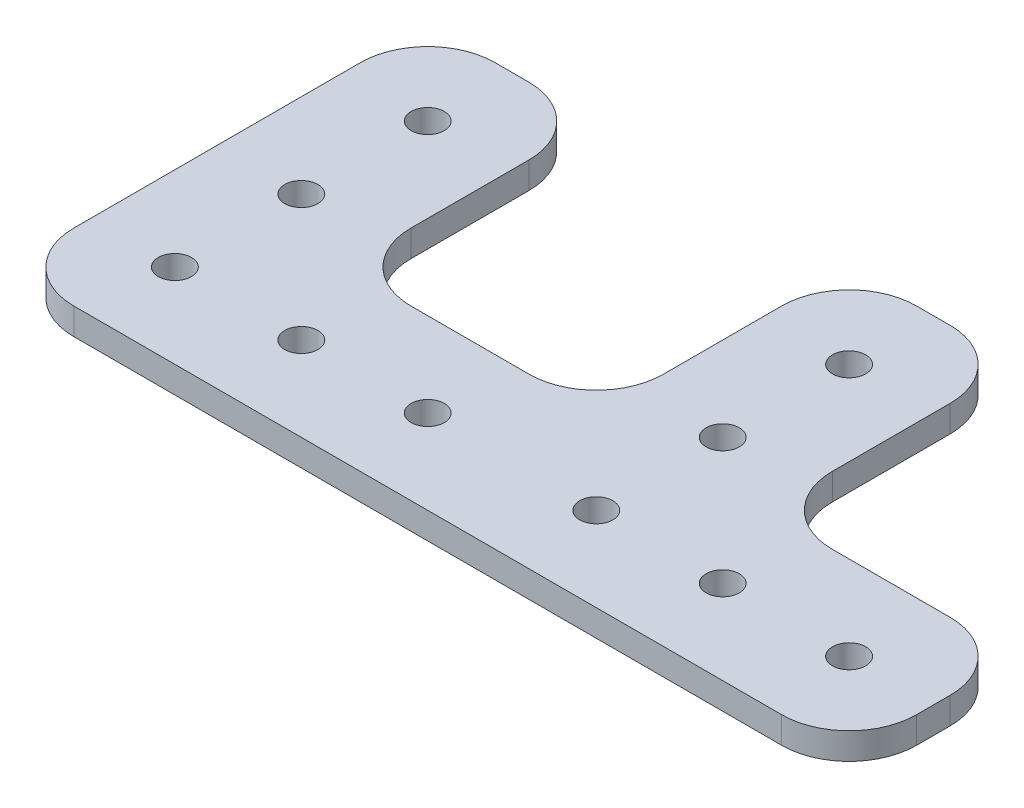
ISO-10303-21;
HEADER;
FILE_DESCRIPTION(('STEP AP214'),'2;1');
FILE_NAME('part.step','',(''),(''),'','','');
FILE_SCHEMA(('AUTOMOTIVE_DESIGN { 1 0 10303 214 1 1 1 1 }'));
ENDSEC;
DATA;
#1=APPLICATION_CONTEXT('core data for automotive mechanical design processes');
#2=APPLICATION_PROTOCOL_DEFINITION('international standard','automotive_design',2000,#1);
#3=PRODUCT_CONTEXT('',#1,'mechanical');
#4=PRODUCT('Part','Part','',(#3));
#5=PRODUCT_RELATED_PRODUCT_CATEGORY('part','',(#4));
#6=PRODUCT_DEFINITION_FORMATION('','',#4);
#7=PRODUCT_DEFINITION_CONTEXT('part definition',#1,'design');
#8=PRODUCT_DEFINITION('design','',#6,#7);
#9=PRODUCT_DEFINITION_SHAPE('','',#8);
#10=(LENGTH_UNIT() NAMED_UNIT(*) SI_UNIT(.MILLI.,.METRE.));
#11=(NAMED_UNIT(*) PLANE_ANGLE_UNIT() SI_UNIT($,.RADIAN.));
#12=(NAMED_UNIT(*) SI_UNIT($,.STERADIAN.) SOLID_ANGLE_UNIT());
#13=UNCERTAINTY_MEASURE_WITH_UNIT(LENGTH_MEASURE(1.E-05),#10,'distance_accuracy_value','');
#14=(GEOMETRIC_REPRESENTATION_CONTEXT(3) GLOBAL_UNCERTAINTY_ASSIGNED_CONTEXT((#13)) GLOBAL_UNIT_ASSIGNED_CONTEXT((#10,
#11,#12)) REPRESENTATION_CONTEXT('',''));
#15=CARTESIAN_POINT('',(0.,0.,0.));
#16=DIRECTION('',(0.,0.,1.));
#17=DIRECTION('',(1.,0.,0.));
#18=AXIS2_PLACEMENT_3D('',#15,#16,#17);
#19=CARTESIAN_POINT('',(1.00323177257206E-12,29.3999999999989,304.8));
#20=DIRECTION('',(0.,0.,-1.));
#21=DIRECTION('',(-1.,0.,0.));
#22=AXIS2_PLACEMENT_3D('',#19,#20,#21);
#23=PLANE('',#22);
#24=DIRECTION('',(1.,0.,0.));
#25=VECTOR('',#24,1.);
#26=CARTESIAN_POINT('',(1.01719769792743E-12,25.3999999999989,304.8));
#27=LINE('',#26,#25);
#28=CARTESIAN_POINT('',(-180.339999999999,25.3999999999983,304.800000000001));
#29=VERTEX_POINT('',#28);
#30=CARTESIAN_POINT('',(-73.659999999999,25.3999999999987,304.8));
#31=VERTEX_POINT('',#30);
#32=EDGE_CURVE('E405',#29,#31,#27,.T.);
#33=ORIENTED_EDGE('',*,*,#32,.T.);
#34=DIRECTION('',(0.,-1.,0.));
#35=VECTOR('',#34,1.);
#36=CARTESIAN_POINT('',(-73.659999999999,29.3999999999987,304.8));
#37=LINE('',#36,#35);
#38=CARTESIAN_POINT('',(-73.659999999999,29.3999999999987,304.8));
#39=VERTEX_POINT('',#38);
#40=EDGE_CURVE('E293',#31,#39,#37,.F.);
#41=ORIENTED_EDGE('',*,*,#40,.T.);
#42=DIRECTION('',(1.,0.,0.));
#43=VECTOR('',#42,1.);
#44=CARTESIAN_POINT('',(1.00323177257206E-12,29.3999999999989,304.8));
#45=LINE('',#44,#43);
#46=CARTESIAN_POINT('',(-180.339999999999,29.3999999999983,304.800000000001));
#47=VERTEX_POINT('',#46);
#48=EDGE_CURVE('E352',#47,#39,#45,.T.);
#49=ORIENTED_EDGE('',*,*,#48,.F.);
#50=DIRECTION('',(0.,-1.,0.));
#51=VECTOR('',#50,1.);
#52=CARTESIAN_POINT('',(-180.339999999999,29.3999999999983,304.800000000001));
#53=LINE('',#52,#51);
#54=EDGE_CURVE('E289',#47,#29,#53,.T.);
#55=ORIENTED_EDGE('',*,*,#54,.T.);
#56=EDGE_LOOP('',(#33,#41,#49,#55));
#57=FACE_BOUND('',#56,.T.);
#58=ADVANCED_FACE('F41',(#57),#23,.F.);
#59=CARTESIAN_POINT('',(-63.4999999999991,29.3999999999998,1.02605102930766E-13));
#60=DIRECTION('',(-1.,0.,0.));
#61=DIRECTION('',(0.,-1.,0.));
#62=AXIS2_PLACEMENT_3D('',#59,#60,#61);
#63=PLANE('',#62);
#64=DIRECTION('',(0.,0.,-1.));
#65=VECTOR('',#64,1.);
#66=CARTESIAN_POINT('',(-63.4999999999991,25.3999999999998,0.));
#67=LINE('',#66,#65);
#68=CARTESIAN_POINT('',(-63.4999999999991,25.3999999999987,294.64));
#69=VERTEX_POINT('',#68);
#70=CARTESIAN_POINT('',(-63.4999999999991,25.3999999999988,289.56));
#71=VERTEX_POINT('',#70);
#72=EDGE_CURVE('E410',#69,#71,#67,.T.);
#73=ORIENTED_EDGE('',*,*,#72,.T.);
#74=DIRECTION('',(0.,-1.,0.));
#75=VECTOR('',#74,1.);
#76=CARTESIAN_POINT('',(-63.4999999999991,29.3999999999988,289.56));
#77=LINE('',#76,#75);
#78=CARTESIAN_POINT('',(-63.4999999999991,29.3999999999988,289.56));
#79=VERTEX_POINT('',#78);
#80=EDGE_CURVE('E287',#71,#79,#77,.F.);
#81=ORIENTED_EDGE('',*,*,#80,.T.);
#82=DIRECTION('',(0.,0.,-1.));
#83=VECTOR('',#82,1.);
#84=CARTESIAN_POINT('',(-63.4999999999991,29.3999999999998,1.02605102930766E-13));
#85=LINE('',#84,#83);
#86=CARTESIAN_POINT('',(-63.4999999999991,29.3999999999987,294.64));
#87=VERTEX_POINT('',#86);
#88=EDGE_CURVE('E347',#87,#79,#85,.T.);
#89=ORIENTED_EDGE('',*,*,#88,.F.);
#90=DIRECTION('',(0.,-1.,0.));
#91=VECTOR('',#90,1.);
#92=CARTESIAN_POINT('',(-63.4999999999991,29.3999999999987,294.64));
#93=LINE('',#92,#91);
#94=EDGE_CURVE('E284',#87,#69,#93,.T.);
#95=ORIENTED_EDGE('',*,*,#94,.T.);
#96=EDGE_LOOP('',(#73,#81,#89,#95));
#97=FACE_BOUND('',#96,.T.);
#98=ADVANCED_FACE('F484',(#97),#63,.F.);
#99=CARTESIAN_POINT('',(9.11078699613493E-13,29.399999999999,279.4));
#100=DIRECTION('',(0.,0.,1.));
#101=DIRECTION('',(1.,0.,0.));
#102=AXIS2_PLACEMENT_3D('',#99,#100,#101);
#103=PLANE('',#102);
#104=DIRECTION('',(-1.,0.,0.));
#105=VECTOR('',#104,1.);
#106=CARTESIAN_POINT('',(9.11078699613493E-13,29.399999999999,279.4));
#107=LINE('',#106,#105);
#108=CARTESIAN_POINT('',(-73.6599999999991,29.3999999999988,279.4));
#109=VERTEX_POINT('',#108);
#110=CARTESIAN_POINT('',(-91.4400000000001,29.3999999999987,279.4));
#111=VERTEX_POINT('',#110);
#112=EDGE_CURVE('E338',#109,#111,#107,.T.);
#113=ORIENTED_EDGE('',*,*,#112,.F.);
#114=DIRECTION('',(0.,-1.,0.));
#115=VECTOR('',#114,1.);
#116=CARTESIAN_POINT('',(-73.6599999999991,29.3999999999988,279.4));
#117=LINE('',#116,#115);
#118=CARTESIAN_POINT('',(-73.6599999999991,25.3999999999988,279.4));
#119=VERTEX_POINT('',#118);
#120=EDGE_CURVE('E281',#109,#119,#117,.T.);
#121=ORIENTED_EDGE('',*,*,#120,.T.);
#122=DIRECTION('',(-1.,0.,0.));
#123=VECTOR('',#122,1.);
#124=CARTESIAN_POINT('',(9.25044624968866E-13,25.399999999999,279.4));
#125=LINE('',#124,#123);
#126=CARTESIAN_POINT('',(-91.4400000000001,25.3999999999987,279.4));
#127=VERTEX_POINT('',#126);
#128=EDGE_CURVE('E420',#119,#127,#125,.T.);
#129=ORIENTED_EDGE('',*,*,#128,.T.);
#130=DIRECTION('',(0.,-1.,0.));
#131=VECTOR('',#130,1.);
#132=CARTESIAN_POINT('',(-91.4400000000001,29.3999999999987,279.4));
#133=LINE('',#132,#131);
#134=EDGE_CURVE('E279',#127,#111,#133,.F.);
#135=ORIENTED_EDGE('',*,*,#134,.T.);
#136=EDGE_LOOP('',(#113,#121,#129,#135));
#137=FACE_BOUND('',#136,.T.);
#138=ADVANCED_FACE('F490',(#137),#103,.F.);
#139=CARTESIAN_POINT('',(-101.6,29.3999999999996,1.02605102930766E-13));
#140=DIRECTION('',(-1.,0.,0.));
#141=DIRECTION('',(0.,-1.,0.));
#142=AXIS2_PLACEMENT_3D('',#139,#140,#141);
#143=PLANE('',#142);
#144=DIRECTION('',(0.,0.,-1.));
#145=VECTOR('',#144,1.);
#146=CARTESIAN_POINT('',(-101.6,25.3999999999996,0.));
#147=LINE('',#146,#145);
#148=CARTESIAN_POINT('',(-101.6,25.3999999999987,269.24));
#149=VERTEX_POINT('',#148);
#150=CARTESIAN_POINT('',(-101.6,25.3999999999988,251.459999999999));
#151=VERTEX_POINT('',#150);
#152=EDGE_CURVE('E423',#149,#151,#147,.T.);
#153=ORIENTED_EDGE('',*,*,#152,.T.);
#154=DIRECTION('',(0.,-1.,0.));
#155=VECTOR('',#154,1.);
#156=CARTESIAN_POINT('',(-101.6,29.3999999999988,251.459999999999));
#157=LINE('',#156,#155);
#158=CARTESIAN_POINT('',(-101.6,29.3999999999988,251.459999999999));
#159=VERTEX_POINT('',#158);
#160=EDGE_CURVE('E277',#151,#159,#157,.F.);
#161=ORIENTED_EDGE('',*,*,#160,.T.);
#162=DIRECTION('',(0.,0.,-1.));
#163=VECTOR('',#162,1.);
#164=CARTESIAN_POINT('',(-101.6,29.3999999999996,1.02605102930766E-13));
#165=LINE('',#164,#163);
#166=CARTESIAN_POINT('',(-101.6,29.3999999999987,269.24));
#167=VERTEX_POINT('',#166);
#168=EDGE_CURVE('E346',#167,#159,#165,.T.);
#169=ORIENTED_EDGE('',*,*,#168,.F.);
#170=DIRECTION('',(0.,-1.,0.));
#171=VECTOR('',#170,1.);
#172=CARTESIAN_POINT('',(-101.6,25.3999999999987,269.24));
#173=LINE('',#172,#171);
#174=EDGE_CURVE('E274',#167,#149,#173,.T.);
#175=ORIENTED_EDGE('',*,*,#174,.T.);
#176=EDGE_LOOP('',(#153,#161,#169,#175));
#177=FACE_BOUND('',#176,.T.);
#178=ADVANCED_FACE('F494',(#177),#143,.F.);
#179=CARTESIAN_POINT('',(-1.02605102930764E-13,29.3999999999991,241.299999999999));
#180=DIRECTION('',(0.,0.,1.));
#181=DIRECTION('',(0.,-1.,0.));
#182=AXIS2_PLACEMENT_3D('',#179,#180,#181);
#183=PLANE('',#182);
#184=DIRECTION('',(-1.,0.,0.));
#185=VECTOR('',#184,1.);
#186=CARTESIAN_POINT('',(0.,25.3999999999991,241.299999999999));
#187=LINE('',#186,#185);
#188=CARTESIAN_POINT('',(-111.76,25.3999999999988,241.299999999999));
#189=VERTEX_POINT('',#188);
#190=CARTESIAN_POINT('',(-116.84,25.3999999999987,241.299999999999));
#191=VERTEX_POINT('',#190);
#192=EDGE_CURVE('E323',#189,#191,#187,.T.);
#193=ORIENTED_EDGE('',*,*,#192,.T.);
#194=DIRECTION('',(0.,-1.,0.));
#195=VECTOR('',#194,1.);
#196=CARTESIAN_POINT('',(-116.84,29.3999999999987,241.299999999999));
#197=LINE('',#196,#195);
#198=CARTESIAN_POINT('',(-116.84,29.3999999999987,241.299999999999));
#199=VERTEX_POINT('',#198);
#200=EDGE_CURVE('E272',#191,#199,#197,.F.);
#201=ORIENTED_EDGE('',*,*,#200,.T.);
#202=DIRECTION('',(-1.,0.,0.));
#203=VECTOR('',#202,1.);
#204=CARTESIAN_POINT('',(-1.02605102930764E-13,29.3999999999991,241.299999999999));
#205=LINE('',#204,#203);
#206=CARTESIAN_POINT('',(-111.76,29.3999999999988,241.299999999999));
#207=VERTEX_POINT('',#206);
#208=EDGE_CURVE('E341',#207,#199,#205,.T.);
#209=ORIENTED_EDGE('',*,*,#208,.F.);
#210=DIRECTION('',(0.,-1.,0.));
#211=VECTOR('',#210,1.);
#212=CARTESIAN_POINT('',(-111.76,29.3999999999988,241.299999999999));
#213=LINE('',#212,#211);
#214=EDGE_CURVE('E269',#207,#189,#213,.T.);
#215=ORIENTED_EDGE('',*,*,#214,.T.);
#216=EDGE_LOOP('',(#193,#201,#209,#215));
#217=FACE_BOUND('',#216,.T.);
#218=ADVANCED_FACE('F497',(#217),#183,.F.);
#219=CARTESIAN_POINT('',(-127.,29.3999999999995,0.));
#220=DIRECTION('',(1.,0.,0.));
#221=DIRECTION('',(0.,1.,0.));
#222=AXIS2_PLACEMENT_3D('',#219,#220,#221);
#223=PLANE('',#222);
#224=DIRECTION('',(0.,0.,1.));
#225=VECTOR('',#224,1.);
#226=CARTESIAN_POINT('',(-127.,29.3999999999995,0.));
#227=LINE('',#226,#225);
#228=CARTESIAN_POINT('',(-127.,29.3999999999987,251.459999999999));
#229=VERTEX_POINT('',#228);
#230=CARTESIAN_POINT('',(-127.,29.3999999999986,269.24));
#231=VERTEX_POINT('',#230);
#232=EDGE_CURVE('E331',#229,#231,#227,.T.);
#233=ORIENTED_EDGE('',*,*,#232,.F.);
#234=DIRECTION('',(0.,-1.,0.));
#235=VECTOR('',#234,1.);
#236=CARTESIAN_POINT('',(-127.,29.3999999999987,251.459999999999));
#237=LINE('',#236,#235);
#238=CARTESIAN_POINT('',(-127.,25.3999999999987,251.459999999999));
#239=VERTEX_POINT('',#238);
#240=EDGE_CURVE('E266',#229,#239,#237,.T.);
#241=ORIENTED_EDGE('',*,*,#240,.T.);
#242=DIRECTION('',(0.,0.,1.));
#243=VECTOR('',#242,1.);
#244=CARTESIAN_POINT('',(-127.,25.3999999999995,0.));
#245=LINE('',#244,#243);
#246=CARTESIAN_POINT('',(-127.,25.3999999999986,269.24));
#247=VERTEX_POINT('',#246);
#248=EDGE_CURVE('E312',#239,#247,#245,.T.);
#249=ORIENTED_EDGE('',*,*,#248,.T.);
#250=DIRECTION('',(0.,-1.,0.));
#251=VECTOR('',#250,1.);
#252=CARTESIAN_POINT('',(-127.,29.3999999999986,269.24));
#253=LINE('',#252,#251);
#254=EDGE_CURVE('E264',#247,#231,#253,.F.);
#255=ORIENTED_EDGE('',*,*,#254,.T.);
#256=EDGE_LOOP('',(#233,#241,#249,#255));
#257=FACE_BOUND('',#256,.T.);
#258=ADVANCED_FACE('F320',(#257),#223,.F.);
#259=CARTESIAN_POINT('',(-137.16,25.3999999999985,279.4));
#260=VERTEX_POINT('',#259);
#261=CARTESIAN_POINT('',(-154.94,25.3999999999985,279.4));
#262=VERTEX_POINT('',#261);
#263=EDGE_CURVE('E314',#260,#262,#125,.T.);
#264=ORIENTED_EDGE('',*,*,#263,.T.);
#265=DIRECTION('',(0.,-1.,0.));
#266=VECTOR('',#265,1.);
#267=CARTESIAN_POINT('',(-154.94,29.3999999999985,279.4));
#268=LINE('',#267,#266);
#269=CARTESIAN_POINT('',(-154.94,29.3999999999985,279.4));
#270=VERTEX_POINT('',#269);
#271=EDGE_CURVE('E298',#262,#270,#268,.F.);
#272=ORIENTED_EDGE('',*,*,#271,.T.);
#273=CARTESIAN_POINT('',(-137.16,29.3999999999985,279.4));
#274=VERTEX_POINT('',#273);
#275=EDGE_CURVE('E330',#274,#270,#107,.T.);
#276=ORIENTED_EDGE('',*,*,#275,.F.);
#277=DIRECTION('',(0.,-1.,0.));
#278=VECTOR('',#277,1.);
#279=CARTESIAN_POINT('',(-137.16,25.3999999999985,279.4));
#280=LINE('',#279,#278);
#281=EDGE_CURVE('E295',#274,#260,#280,.T.);
#282=ORIENTED_EDGE('',*,*,#281,.T.);
#283=EDGE_LOOP('',(#264,#272,#276,#282));
#284=FACE_BOUND('',#283,.T.);
#285=ADVANCED_FACE('F333',(#284),#103,.F.);
#286=CARTESIAN_POINT('',(-165.1,29.3999999999994,1.02605102930765E-13));
#287=DIRECTION('',(-1.,0.,0.));
#288=DIRECTION('',(0.,-1.,0.));
#289=AXIS2_PLACEMENT_3D('',#286,#287,#288);
#290=PLANE('',#289);
#291=DIRECTION('',(0.,0.,-1.));
#292=VECTOR('',#291,1.);
#293=CARTESIAN_POINT('',(-165.1,25.3999999999994,0.));
#294=LINE('',#293,#292);
#295=CARTESIAN_POINT('',(-165.1,25.3999999999985,269.24));
#296=VERTEX_POINT('',#295);
#297=CARTESIAN_POINT('',(-165.1,25.3999999999985,251.459999999999));
#298=VERTEX_POINT('',#297);
#299=EDGE_CURVE('E216',#296,#298,#294,.T.);
#300=ORIENTED_EDGE('',*,*,#299,.T.);
#301=DIRECTION('',(0.,-1.,0.));
#302=VECTOR('',#301,1.);
#303=CARTESIAN_POINT('',(-165.1,29.3999999999985,251.459999999999));
#304=LINE('',#303,#302);
#305=CARTESIAN_POINT('',(-165.1,29.3999999999985,251.459999999999));
#306=VERTEX_POINT('',#305);
#307=EDGE_CURVE('E56',#298,#306,#304,.F.);
#308=ORIENTED_EDGE('',*,*,#307,.T.);
#309=DIRECTION('',(0.,0.,-1.));
#310=VECTOR('',#309,1.);
#311=CARTESIAN_POINT('',(-165.1,29.3999999999994,1.02605102930765E-13));
#312=LINE('',#311,#310);
#313=CARTESIAN_POINT('',(-165.1,29.3999999999985,269.24));
#314=VERTEX_POINT('',#313);
#315=EDGE_CURVE('E336',#314,#306,#312,.T.);
#316=ORIENTED_EDGE('',*,*,#315,.F.);
#317=DIRECTION('',(0.,-1.,0.));
#318=VECTOR('',#317,1.);
#319=CARTESIAN_POINT('',(-165.1,25.3999999999985,269.24));
#320=LINE('',#319,#318);
#321=EDGE_CURVE('E260',#314,#296,#320,.T.);
#322=ORIENTED_EDGE('',*,*,#321,.T.);
#323=EDGE_LOOP('',(#300,#308,#316,#322));
#324=FACE_BOUND('',#323,.T.);
#325=ADVANCED_FACE('F432',(#324),#290,.F.);
#326=CARTESIAN_POINT('',(-1.02605102930764E-13,29.3999999999991,241.299999999999));
#327=DIRECTION('',(0.,0.,1.));
#328=DIRECTION('',(0.,-1.,0.));
#329=AXIS2_PLACEMENT_3D('',#326,#327,#328);
#330=PLANE('',#329);
#331=DIRECTION('',(-1.,0.,0.));
#332=VECTOR('',#331,1.);
#333=CARTESIAN_POINT('',(0.,25.3999999999991,241.299999999999));
#334=LINE('',#333,#332);
#335=CARTESIAN_POINT('',(-175.26,25.3999999999985,241.299999999999));
#336=VERTEX_POINT('',#335);
#337=CARTESIAN_POINT('',(-180.339999999999,25.3999999999985,241.299999999999));
#338=VERTEX_POINT('',#337);
#339=EDGE_CURVE('E211',#336,#338,#334,.T.);
#340=ORIENTED_EDGE('',*,*,#339,.T.);
#341=DIRECTION('',(0.,-1.,0.));
#342=VECTOR('',#341,1.);
#343=CARTESIAN_POINT('',(-180.339999999999,29.3999999999985,241.299999999999));
#344=LINE('',#343,#342);
#345=CARTESIAN_POINT('',(-180.339999999999,29.3999999999985,241.299999999999));
#346=VERTEX_POINT('',#345);
#347=EDGE_CURVE('E188',#338,#346,#344,.F.);
#348=ORIENTED_EDGE('',*,*,#347,.T.);
#349=DIRECTION('',(-1.,0.,0.));
#350=VECTOR('',#349,1.);
#351=CARTESIAN_POINT('',(-1.02605102930764E-13,29.3999999999991,241.299999999999));
#352=LINE('',#351,#350);
#353=CARTESIAN_POINT('',(-175.26,29.3999999999985,241.299999999999));
#354=VERTEX_POINT('',#353);
#355=EDGE_CURVE('E339',#354,#346,#352,.T.);
#356=ORIENTED_EDGE('',*,*,#355,.F.);
#357=DIRECTION('',(0.,-1.,0.));
#358=VECTOR('',#357,1.);
#359=CARTESIAN_POINT('',(-175.26,29.3999999999985,241.299999999999));
#360=LINE('',#359,#358);
#361=EDGE_CURVE('E193',#354,#336,#360,.T.);
#362=ORIENTED_EDGE('',*,*,#361,.T.);
#363=EDGE_LOOP('',(#340,#348,#356,#362));
#364=FACE_BOUND('',#363,.T.);
#365=ADVANCED_FACE('F439',(#364),#330,.F.);
#366=CARTESIAN_POINT('',(-114.3,29.3999999999987,254.));
#367=DIRECTION('',(0.,-1.,0.));
#368=DIRECTION('',(1.,0.,0.));
#369=AXIS2_PLACEMENT_3D('',#366,#367,#368);
#370=CYLINDRICAL_SURFACE('',#369,2.50000000000001);
#371=CARTESIAN_POINT('',(-114.3,29.3999999999987,254.));
#372=DIRECTION('',(0.,1.,0.));
#373=DIRECTION('',(0.,0.,1.));
#374=AXIS2_PLACEMENT_3D('',#371,#372,#373);
#375=CIRCLE('',#374,2.50000000000001);
#376=CARTESIAN_POINT('',(-114.3,29.3999999999987,256.5));
#377=VERTEX_POINT('',#376);
#378=EDGE_CURVE('E449',#377,#377,#375,.T.);
#379=ORIENTED_EDGE('',*,*,#378,.T.);
#380=EDGE_LOOP('',(#379));
#381=FACE_BOUND('',#380,.T.);
#382=CARTESIAN_POINT('',(-114.3,25.3999999999987,254.));
#383=DIRECTION('',(0.,1.,0.));
#384=DIRECTION('',(0.,0.,1.));
#385=AXIS2_PLACEMENT_3D('',#382,#383,#384);
#386=CIRCLE('',#385,2.50000000000001);
#387=CARTESIAN_POINT('',(-114.3,25.3999999999987,256.5));
#388=VERTEX_POINT('',#387);
#389=EDGE_CURVE('E222',#388,#388,#386,.T.);
#390=ORIENTED_EDGE('',*,*,#389,.F.);
#391=EDGE_LOOP('',(#390));
#392=FACE_BOUND('',#391,.T.);
#393=ADVANCED_FACE('F510',(#381,#392),#370,.F.);
#394=CARTESIAN_POINT('',(-177.8,29.3999999999984,273.05));
#395=DIRECTION('',(0.,-1.,0.));
#396=DIRECTION('',(1.,0.,0.));
#397=AXIS2_PLACEMENT_3D('',#394,#395,#396);
#398=CYLINDRICAL_SURFACE('',#397,2.5);
#399=CARTESIAN_POINT('',(-177.8,29.3999999999984,273.05));
#400=DIRECTION('',(0.,1.,0.));
#401=DIRECTION('',(0.,0.,1.));
#402=AXIS2_PLACEMENT_3D('',#399,#400,#401);
#403=CIRCLE('',#402,2.5);
#404=CARTESIAN_POINT('',(-177.8,29.3999999999984,275.55));
#405=VERTEX_POINT('',#404);
#406=EDGE_CURVE('E446',#405,#405,#403,.T.);
#407=ORIENTED_EDGE('',*,*,#406,.T.);
#408=EDGE_LOOP('',(#407));
#409=FACE_BOUND('',#408,.T.);
#410=CARTESIAN_POINT('',(-177.8,25.3999999999984,273.05));
#411=DIRECTION('',(0.,1.,0.));
#412=DIRECTION('',(0.,0.,1.));
#413=AXIS2_PLACEMENT_3D('',#410,#411,#412);
#414=CIRCLE('',#413,2.5);
#415=CARTESIAN_POINT('',(-177.8,25.3999999999984,275.55));
#416=VERTEX_POINT('',#415);
#417=EDGE_CURVE('E214',#416,#416,#414,.T.);
#418=ORIENTED_EDGE('',*,*,#417,.F.);
#419=EDGE_LOOP('',(#418));
#420=FACE_BOUND('',#419,.T.);
#421=ADVANCED_FACE('F516',(#409,#420),#398,.F.);
#422=CARTESIAN_POINT('',(-177.8,29.3999999999985,254.));
#423=DIRECTION('',(0.,-1.,0.));
#424=DIRECTION('',(1.,0.,0.));
#425=AXIS2_PLACEMENT_3D('',#422,#423,#424);
#426=CYLINDRICAL_SURFACE('',#425,2.5);
#427=CARTESIAN_POINT('',(-177.8,29.3999999999985,254.));
#428=DIRECTION('',(0.,1.,0.));
#429=DIRECTION('',(0.,0.,1.));
#430=AXIS2_PLACEMENT_3D('',#427,#428,#429);
#431=CIRCLE('',#430,2.5);
#432=CARTESIAN_POINT('',(-177.8,29.3999999999985,256.5));
#433=VERTEX_POINT('',#432);
#434=EDGE_CURVE('E441',#433,#433,#431,.T.);
#435=ORIENTED_EDGE('',*,*,#434,.T.);
#436=EDGE_LOOP('',(#435));
#437=FACE_BOUND('',#436,.T.);
#438=CARTESIAN_POINT('',(-177.8,25.3999999999985,254.));
#439=DIRECTION('',(0.,1.,0.));
#440=DIRECTION('',(0.,0.,1.));
#441=AXIS2_PLACEMENT_3D('',#438,#439,#440);
#442=CIRCLE('',#441,2.5);
#443=CARTESIAN_POINT('',(-177.8,25.3999999999985,256.5));
#444=VERTEX_POINT('',#443);
#445=EDGE_CURVE('E210',#444,#444,#442,.T.);
#446=ORIENTED_EDGE('',*,*,#445,.F.);
#447=EDGE_LOOP('',(#446));
#448=FACE_BOUND('',#447,.T.);
#449=ADVANCED_FACE('F513',(#437,#448),#426,.F.);
#450=CARTESIAN_POINT('',(-190.5,29.3999999999993,7.93753150120034E-13));
#451=DIRECTION('',(1.,0.,0.));
#452=DIRECTION('',(0.,0.,-1.));
#453=AXIS2_PLACEMENT_3D('',#450,#451,#452);
#454=PLANE('',#453);
#455=DIRECTION('',(0.,0.,1.));
#456=VECTOR('',#455,1.);
#457=CARTESIAN_POINT('',(-190.5,29.3999999999993,7.93753150120034E-13));
#458=LINE('',#457,#456);
#459=CARTESIAN_POINT('',(-190.499999999999,29.3999999999984,251.459999999999));
#460=VERTEX_POINT('',#459);
#461=CARTESIAN_POINT('',(-190.499999999999,29.3999999999983,294.640000000001));
#462=VERTEX_POINT('',#461);
#463=EDGE_CURVE('E203',#460,#462,#458,.T.);
#464=ORIENTED_EDGE('',*,*,#463,.F.);
#465=DIRECTION('',(0.,-1.,0.));
#466=VECTOR('',#465,1.);
#467=CARTESIAN_POINT('',(-190.499999999999,29.3999999999984,251.459999999999));
#468=LINE('',#467,#466);
#469=CARTESIAN_POINT('',(-190.499999999999,25.3999999999984,251.459999999999));
#470=VERTEX_POINT('',#469);
#471=EDGE_CURVE('E187',#460,#470,#468,.T.);
#472=ORIENTED_EDGE('',*,*,#471,.T.);
#473=DIRECTION('',(0.,0.,1.));
#474=VECTOR('',#473,1.);
#475=CARTESIAN_POINT('',(-190.5,25.3999999999993,7.79787224764662E-13));
#476=LINE('',#475,#474);
#477=CARTESIAN_POINT('',(-190.499999999999,25.3999999999983,294.640000000001));
#478=VERTEX_POINT('',#477);
#479=EDGE_CURVE('E200',#470,#478,#476,.T.);
#480=ORIENTED_EDGE('',*,*,#479,.T.);
#481=DIRECTION('',(0.,-1.,0.));
#482=VECTOR('',#481,1.);
#483=CARTESIAN_POINT('',(-190.499999999999,29.3999999999983,294.640000000001));
#484=LINE('',#483,#482);
#485=EDGE_CURVE('E205',#478,#462,#484,.F.);
#486=ORIENTED_EDGE('',*,*,#485,.T.);
#487=EDGE_LOOP('',(#464,#472,#480,#486));
#488=FACE_BOUND('',#487,.T.);
#489=ADVANCED_FACE('F199',(#488),#454,.F.);
#490=CARTESIAN_POINT('',(-114.3,29.3999999999986,292.1));
#491=DIRECTION('',(0.,-1.,0.));
#492=DIRECTION('',(1.,0.,0.));
#493=AXIS2_PLACEMENT_3D('',#490,#491,#492);
#494=CYLINDRICAL_SURFACE('',#493,2.50000000000001);
#495=CARTESIAN_POINT('',(-114.3,29.3999999999986,292.1));
#496=DIRECTION('',(0.,1.,0.));
#497=DIRECTION('',(0.,0.,1.));
#498=AXIS2_PLACEMENT_3D('',#495,#496,#497);
#499=CIRCLE('',#498,2.50000000000001);
#500=CARTESIAN_POINT('',(-114.3,29.3999999999986,294.6));
#501=VERTEX_POINT('',#500);
#502=EDGE_CURVE('E357',#501,#501,#499,.T.);
#503=ORIENTED_EDGE('',*,*,#502,.T.);
#504=EDGE_LOOP('',(#503));
#505=FACE_BOUND('',#504,.T.);
#506=CARTESIAN_POINT('',(-114.3,25.3999999999986,292.1));
#507=DIRECTION('',(0.,1.,0.));
#508=DIRECTION('',(0.,0.,1.));
#509=AXIS2_PLACEMENT_3D('',#506,#507,#508);
#510=CIRCLE('',#509,2.50000000000001);
#511=CARTESIAN_POINT('',(-114.3,25.3999999999986,294.6));
#512=VERTEX_POINT('',#511);
#513=EDGE_CURVE('E403',#512,#512,#510,.T.);
#514=ORIENTED_EDGE('',*,*,#513,.F.);
#515=EDGE_LOOP('',(#514));
#516=FACE_BOUND('',#515,.T.);
#517=ADVANCED_FACE('F396',(#505,#516),#494,.F.);
#518=CARTESIAN_POINT('',(-177.8,29.3999999999983,292.1));
#519=DIRECTION('',(0.,-1.,0.));
#520=DIRECTION('',(1.,0.,0.));
#521=AXIS2_PLACEMENT_3D('',#518,#519,#520);
#522=CYLINDRICAL_SURFACE('',#521,2.5);
#523=CARTESIAN_POINT('',(-177.8,29.3999999999983,292.1));
#524=DIRECTION('',(0.,1.,0.));
#525=DIRECTION('',(0.,0.,1.));
#526=AXIS2_PLACEMENT_3D('',#523,#524,#525);
#527=CIRCLE('',#526,2.5);
#528=CARTESIAN_POINT('',(-177.8,29.3999999999983,294.6));
#529=VERTEX_POINT('',#528);
#530=EDGE_CURVE('E362',#529,#529,#527,.T.);
#531=ORIENTED_EDGE('',*,*,#530,.T.);
#532=EDGE_LOOP('',(#531));
#533=FACE_BOUND('',#532,.T.);
#534=CARTESIAN_POINT('',(-177.8,25.3999999999983,292.1));
#535=DIRECTION('',(0.,1.,0.));
#536=DIRECTION('',(0.,0.,1.));
#537=AXIS2_PLACEMENT_3D('',#534,#535,#536);
#538=CIRCLE('',#537,2.5);
#539=CARTESIAN_POINT('',(-177.8,25.3999999999983,294.6));
#540=VERTEX_POINT('',#539);
#541=EDGE_CURVE('E406',#540,#540,#538,.T.);
#542=ORIENTED_EDGE('',*,*,#541,.F.);
#543=EDGE_LOOP('',(#542));
#544=FACE_BOUND('',#543,.T.);
#545=ADVANCED_FACE('F399',(#533,#544),#522,.F.);
#546=CARTESIAN_POINT('',(-158.75,29.3999999999984,292.1));
#547=DIRECTION('',(0.,-1.,0.));
#548=DIRECTION('',(1.,0.,0.));
#549=AXIS2_PLACEMENT_3D('',#546,#547,#548);
#550=CYLINDRICAL_SURFACE('',#549,2.5);
#551=CARTESIAN_POINT('',(-158.75,29.3999999999984,292.1));
#552=DIRECTION('',(0.,1.,0.));
#553=DIRECTION('',(0.,0.,1.));
#554=AXIS2_PLACEMENT_3D('',#551,#552,#553);
#555=CIRCLE('',#554,2.5);
#556=CARTESIAN_POINT('',(-158.75,29.3999999999984,294.6));
#557=VERTEX_POINT('',#556);
#558=EDGE_CURVE('E366',#557,#557,#555,.T.);
#559=ORIENTED_EDGE('',*,*,#558,.T.);
#560=EDGE_LOOP('',(#559));
#561=FACE_BOUND('',#560,.T.);
#562=CARTESIAN_POINT('',(-158.75,25.3999999999984,292.1));
#563=DIRECTION('',(0.,1.,0.));
#564=DIRECTION('',(0.,0.,1.));
#565=AXIS2_PLACEMENT_3D('',#562,#563,#564);
#566=CIRCLE('',#565,2.5);
#567=CARTESIAN_POINT('',(-158.75,25.3999999999984,294.6));
#568=VERTEX_POINT('',#567);
#569=EDGE_CURVE('E414',#568,#568,#566,.T.);
#570=ORIENTED_EDGE('',*,*,#569,.F.);
#571=EDGE_LOOP('',(#570));
#572=FACE_BOUND('',#571,.T.);
#573=ADVANCED_FACE('F469',(#561,#572),#550,.F.);
#574=CARTESIAN_POINT('',(-95.2500000000001,29.3999999999986,292.1));
#575=DIRECTION('',(0.,-1.,0.));
#576=DIRECTION('',(1.,0.,0.));
#577=AXIS2_PLACEMENT_3D('',#574,#575,#576);
#578=CYLINDRICAL_SURFACE('',#577,2.50000000000001);
#579=CARTESIAN_POINT('',(-95.2500000000001,29.3999999999986,292.1));
#580=DIRECTION('',(0.,1.,0.));
#581=DIRECTION('',(0.,0.,1.));
#582=AXIS2_PLACEMENT_3D('',#579,#580,#581);
#583=CIRCLE('',#582,2.50000000000001);
#584=CARTESIAN_POINT('',(-95.2500000000001,29.3999999999986,294.6));
#585=VERTEX_POINT('',#584);
#586=EDGE_CURVE('E370',#585,#585,#583,.T.);
#587=ORIENTED_EDGE('',*,*,#586,.T.);
#588=EDGE_LOOP('',(#587));
#589=FACE_BOUND('',#588,.T.);
#590=CARTESIAN_POINT('',(-95.2500000000001,25.3999999999986,292.1));
#591=DIRECTION('',(0.,1.,0.));
#592=DIRECTION('',(0.,0.,1.));
#593=AXIS2_PLACEMENT_3D('',#590,#591,#592);
#594=CIRCLE('',#593,2.50000000000001);
#595=CARTESIAN_POINT('',(-95.2500000000001,25.3999999999986,294.6));
#596=VERTEX_POINT('',#595);
#597=EDGE_CURVE('E461',#596,#596,#594,.T.);
#598=ORIENTED_EDGE('',*,*,#597,.F.);
#599=EDGE_LOOP('',(#598));
#600=FACE_BOUND('',#599,.T.);
#601=ADVANCED_FACE('F471',(#589,#600),#578,.F.);
#602=CARTESIAN_POINT('',(-139.7,29.3999999999985,292.1));
#603=DIRECTION('',(0.,-1.,0.));
#604=DIRECTION('',(1.,0.,0.));
#605=AXIS2_PLACEMENT_3D('',#602,#603,#604);
#606=CYLINDRICAL_SURFACE('',#605,2.5);
#607=CARTESIAN_POINT('',(-139.7,29.3999999999985,292.1));
#608=DIRECTION('',(0.,1.,0.));
#609=DIRECTION('',(0.,0.,1.));
#610=AXIS2_PLACEMENT_3D('',#607,#608,#609);
#611=CIRCLE('',#610,2.5);
#612=CARTESIAN_POINT('',(-139.7,29.3999999999985,294.6));
#613=VERTEX_POINT('',#612);
#614=EDGE_CURVE('E373',#613,#613,#611,.T.);
#615=ORIENTED_EDGE('',*,*,#614,.T.);
#616=EDGE_LOOP('',(#615));
#617=FACE_BOUND('',#616,.T.);
#618=CARTESIAN_POINT('',(-139.7,25.3999999999985,292.1));
#619=DIRECTION('',(0.,1.,0.));
#620=DIRECTION('',(0.,0.,1.));
#621=AXIS2_PLACEMENT_3D('',#618,#619,#620);
#622=CIRCLE('',#621,2.5);
#623=CARTESIAN_POINT('',(-139.7,25.3999999999985,294.6));
#624=VERTEX_POINT('',#623);
#625=EDGE_CURVE('E457',#624,#624,#622,.T.);
#626=ORIENTED_EDGE('',*,*,#625,.F.);
#627=EDGE_LOOP('',(#626));
#628=FACE_BOUND('',#627,.T.);
#629=ADVANCED_FACE('F478',(#617,#628),#606,.F.);
#630=CARTESIAN_POINT('',(-76.2000000000001,29.3999999999987,292.1));
#631=DIRECTION('',(0.,-1.,0.));
#632=DIRECTION('',(1.,0.,0.));
#633=AXIS2_PLACEMENT_3D('',#630,#631,#632);
#634=CYLINDRICAL_SURFACE('',#633,2.5);
#635=CARTESIAN_POINT('',(-76.2000000000001,29.3999999999987,292.1));
#636=DIRECTION('',(0.,1.,0.));
#637=DIRECTION('',(0.,0.,1.));
#638=AXIS2_PLACEMENT_3D('',#635,#636,#637);
#639=CIRCLE('',#638,2.5);
#640=CARTESIAN_POINT('',(-76.2000000000001,29.3999999999987,294.6));
#641=VERTEX_POINT('',#640);
#642=EDGE_CURVE('E228',#641,#641,#639,.T.);
#643=ORIENTED_EDGE('',*,*,#642,.T.);
#644=EDGE_LOOP('',(#643));
#645=FACE_BOUND('',#644,.T.);
#646=CARTESIAN_POINT('',(-76.2000000000001,25.3999999999987,292.1));
#647=DIRECTION('',(0.,1.,0.));
#648=DIRECTION('',(0.,0.,1.));
#649=AXIS2_PLACEMENT_3D('',#646,#647,#648);
#650=CIRCLE('',#649,2.5);
#651=CARTESIAN_POINT('',(-76.2000000000001,25.3999999999987,294.6));
#652=VERTEX_POINT('',#651);
#653=EDGE_CURVE('E454',#652,#652,#650,.T.);
#654=ORIENTED_EDGE('',*,*,#653,.F.);
#655=EDGE_LOOP('',(#654));
#656=FACE_BOUND('',#655,.T.);
#657=ADVANCED_FACE('F379',(#645,#656),#634,.F.);
#658=CARTESIAN_POINT('',(-114.3,29.3999999999986,273.05));
#659=DIRECTION('',(0.,-1.,0.));
#660=DIRECTION('',(1.,0.,0.));
#661=AXIS2_PLACEMENT_3D('',#658,#659,#660);
#662=CYLINDRICAL_SURFACE('',#661,2.50000000000001);
#663=CARTESIAN_POINT('',(-114.3,29.3999999999986,273.05));
#664=DIRECTION('',(0.,1.,0.));
#665=DIRECTION('',(0.,0.,1.));
#666=AXIS2_PLACEMENT_3D('',#663,#664,#665);
#667=CIRCLE('',#666,2.50000000000001);
#668=CARTESIAN_POINT('',(-114.3,29.3999999999986,275.55));
#669=VERTEX_POINT('',#668);
#670=EDGE_CURVE('E229',#669,#669,#667,.T.);
#671=ORIENTED_EDGE('',*,*,#670,.T.);
#672=EDGE_LOOP('',(#671));
#673=FACE_BOUND('',#672,.T.);
#674=CARTESIAN_POINT('',(-114.3,25.3999999999986,273.05));
#675=DIRECTION('',(0.,1.,0.));
#676=DIRECTION('',(0.,0.,1.));
#677=AXIS2_PLACEMENT_3D('',#674,#675,#676);
#678=CIRCLE('',#677,2.50000000000001);
#679=CARTESIAN_POINT('',(-114.3,25.3999999999986,275.55));
#680=VERTEX_POINT('',#679);
#681=EDGE_CURVE('E225',#680,#680,#678,.T.);
#682=ORIENTED_EDGE('',*,*,#681,.F.);
#683=EDGE_LOOP('',(#682));
#684=FACE_BOUND('',#683,.T.);
#685=ADVANCED_FACE('F384',(#673,#684),#662,.F.);
#686=CARTESIAN_POINT('',(-1.02605102930767E-13,29.4,1.02605102930767E-13));
#687=DIRECTION('',(0.,1.,0.));
#688=DIRECTION('',(0.,0.,1.));
#689=AXIS2_PLACEMENT_3D('',#686,#687,#688);
#690=PLANE('',#689);
#691=ORIENTED_EDGE('',*,*,#642,.F.);
#692=EDGE_LOOP('',(#691));
#693=FACE_BOUND('',#692,.T.);
#694=ORIENTED_EDGE('',*,*,#614,.F.);
#695=EDGE_LOOP('',(#694));
#696=FACE_BOUND('',#695,.T.);
#697=ORIENTED_EDGE('',*,*,#586,.F.);
#698=EDGE_LOOP('',(#697));
#699=FACE_BOUND('',#698,.T.);
#700=ORIENTED_EDGE('',*,*,#558,.F.);
#701=EDGE_LOOP('',(#700));
#702=FACE_BOUND('',#701,.T.);
#703=ORIENTED_EDGE('',*,*,#530,.F.);
#704=EDGE_LOOP('',(#703));
#705=FACE_BOUND('',#704,.T.);
#706=ORIENTED_EDGE('',*,*,#502,.F.);
#707=EDGE_LOOP('',(#706));
#708=FACE_BOUND('',#707,.T.);
#709=ORIENTED_EDGE('',*,*,#355,.T.);
#710=CARTESIAN_POINT('',(-180.339999999999,29.3999999999985,251.459999999999));
#711=DIRECTION('',(0.,1.,0.));
#712=DIRECTION('',(0.,0.,1.));
#713=AXIS2_PLACEMENT_3D('',#710,#711,#712);
#714=CIRCLE('',#713,10.16);
#715=EDGE_CURVE('E258',#346,#460,#714,.T.);
#716=ORIENTED_EDGE('',*,*,#715,.T.);
#717=ORIENTED_EDGE('',*,*,#463,.T.);
#718=CARTESIAN_POINT('',(-180.339999999999,29.3999999999983,294.640000000001));
#719=DIRECTION('',(0.,1.,0.));
#720=DIRECTION('',(0.,0.,1.));
#721=AXIS2_PLACEMENT_3D('',#718,#719,#720);
#722=CIRCLE('',#721,10.16);
#723=EDGE_CURVE('E245',#462,#47,#722,.T.);
#724=ORIENTED_EDGE('',*,*,#723,.T.);
#725=ORIENTED_EDGE('',*,*,#48,.T.);
#726=CARTESIAN_POINT('',(-73.6599999999991,29.3999999999987,294.64));
#727=DIRECTION('',(0.,1.,0.));
#728=DIRECTION('',(0.,0.,1.));
#729=AXIS2_PLACEMENT_3D('',#726,#727,#728);
#730=CIRCLE('',#729,10.16);
#731=EDGE_CURVE('E248',#39,#87,#730,.T.);
#732=ORIENTED_EDGE('',*,*,#731,.T.);
#733=ORIENTED_EDGE('',*,*,#88,.T.);
#734=CARTESIAN_POINT('',(-73.6599999999991,29.3999999999987,289.56));
#735=DIRECTION('',(0.,1.,0.));
#736=DIRECTION('',(0.,0.,1.));
#737=AXIS2_PLACEMENT_3D('',#734,#735,#736);
#738=CIRCLE('',#737,10.16);
#739=EDGE_CURVE('E250',#79,#109,#738,.T.);
#740=ORIENTED_EDGE('',*,*,#739,.T.);
#741=ORIENTED_EDGE('',*,*,#112,.T.);
#742=CARTESIAN_POINT('',(-91.4400000000001,29.3999999999987,269.24));
#743=DIRECTION('',(0.,1.,0.));
#744=DIRECTION('',(0.,0.,1.));
#745=AXIS2_PLACEMENT_3D('',#742,#743,#744);
#746=CIRCLE('',#745,10.16);
#747=EDGE_CURVE('E303',#111,#167,#746,.F.);
#748=ORIENTED_EDGE('',*,*,#747,.T.);
#749=ORIENTED_EDGE('',*,*,#168,.T.);
#750=CARTESIAN_POINT('',(-111.76,29.3999999999987,251.459999999999));
#751=DIRECTION('',(0.,1.,0.));
#752=DIRECTION('',(0.,0.,1.));
#753=AXIS2_PLACEMENT_3D('',#750,#751,#752);
#754=CIRCLE('',#753,10.16);
#755=EDGE_CURVE('E252',#159,#207,#754,.T.);
#756=ORIENTED_EDGE('',*,*,#755,.T.);
#757=ORIENTED_EDGE('',*,*,#208,.T.);
#758=CARTESIAN_POINT('',(-116.84,29.3999999999987,251.459999999999));
#759=DIRECTION('',(0.,1.,0.));
#760=DIRECTION('',(0.,0.,1.));
#761=AXIS2_PLACEMENT_3D('',#758,#759,#760);
#762=CIRCLE('',#761,10.16);
#763=EDGE_CURVE('E254',#199,#229,#762,.T.);
#764=ORIENTED_EDGE('',*,*,#763,.T.);
#765=ORIENTED_EDGE('',*,*,#232,.T.);
#766=CARTESIAN_POINT('',(-137.16,29.3999999999986,269.24));
#767=DIRECTION('',(0.,1.,0.));
#768=DIRECTION('',(0.,0.,1.));
#769=AXIS2_PLACEMENT_3D('',#766,#767,#768);
#770=CIRCLE('',#769,10.16);
#771=EDGE_CURVE('E11',#231,#274,#770,.F.);
#772=ORIENTED_EDGE('',*,*,#771,.T.);
#773=ORIENTED_EDGE('',*,*,#275,.T.);
#774=CARTESIAN_POINT('',(-154.94,29.3999999999985,269.24));
#775=DIRECTION('',(0.,1.,0.));
#776=DIRECTION('',(0.,0.,1.));
#777=AXIS2_PLACEMENT_3D('',#774,#775,#776);
#778=CIRCLE('',#777,10.16);
#779=EDGE_CURVE('E63',#270,#314,#778,.F.);
#780=ORIENTED_EDGE('',*,*,#779,.T.);
#781=ORIENTED_EDGE('',*,*,#315,.T.);
#782=CARTESIAN_POINT('',(-175.26,29.3999999999985,251.459999999999));
#783=DIRECTION('',(0.,1.,0.));
#784=DIRECTION('',(0.,0.,1.));
#785=AXIS2_PLACEMENT_3D('',#782,#783,#784);
#786=CIRCLE('',#785,10.16);
#787=EDGE_CURVE('E256',#306,#354,#786,.T.);
#788=ORIENTED_EDGE('',*,*,#787,.T.);
#789=EDGE_LOOP('',(#709,#716,#717,#724,#725,#732,#733,#740,#741,#748,#749,#756,#757,#764,#765,
#772,#773,#780,#781,#788));
#790=FACE_BOUND('',#789,.T.);
#791=ORIENTED_EDGE('',*,*,#434,.F.);
#792=EDGE_LOOP('',(#791));
#793=FACE_BOUND('',#792,.T.);
#794=ORIENTED_EDGE('',*,*,#406,.F.);
#795=EDGE_LOOP('',(#794));
#796=FACE_BOUND('',#795,.T.);
#797=ORIENTED_EDGE('',*,*,#378,.F.);
#798=EDGE_LOOP('',(#797));
#799=FACE_BOUND('',#798,.T.);
#800=ORIENTED_EDGE('',*,*,#670,.F.);
#801=EDGE_LOOP('',(#800));
#802=FACE_BOUND('',#801,.T.);
#803=ADVANCED_FACE('F328',(#693,#696,#699,#702,#705,#708,#790,#793,#796,#799,#802),#690,.T.);
#804=CARTESIAN_POINT('',(0.,25.4,0.));
#805=DIRECTION('',(0.,1.,0.));
#806=DIRECTION('',(0.,0.,1.));
#807=AXIS2_PLACEMENT_3D('',#804,#805,#806);
#808=PLANE('',#807);
#809=ORIENTED_EDGE('',*,*,#653,.T.);
#810=EDGE_LOOP('',(#809));
#811=FACE_BOUND('',#810,.T.);
#812=ORIENTED_EDGE('',*,*,#625,.T.);
#813=EDGE_LOOP('',(#812));
#814=FACE_BOUND('',#813,.T.);
#815=ORIENTED_EDGE('',*,*,#597,.T.);
#816=EDGE_LOOP('',(#815));
#817=FACE_BOUND('',#816,.T.);
#818=ORIENTED_EDGE('',*,*,#569,.T.);
#819=EDGE_LOOP('',(#818));
#820=FACE_BOUND('',#819,.T.);
#821=ORIENTED_EDGE('',*,*,#541,.T.);
#822=EDGE_LOOP('',(#821));
#823=FACE_BOUND('',#822,.T.);
#824=ORIENTED_EDGE('',*,*,#513,.T.);
#825=EDGE_LOOP('',(#824));
#826=FACE_BOUND('',#825,.T.);
#827=ORIENTED_EDGE('',*,*,#479,.F.);
#828=CARTESIAN_POINT('',(-180.339999999999,25.3999999999985,251.459999999999));
#829=DIRECTION('',(0.,1.,0.));
#830=DIRECTION('',(0.,0.,1.));
#831=AXIS2_PLACEMENT_3D('',#828,#829,#830);
#832=CIRCLE('',#831,10.16);
#833=EDGE_CURVE('E183',#470,#338,#832,.F.);
#834=ORIENTED_EDGE('',*,*,#833,.T.);
#835=ORIENTED_EDGE('',*,*,#339,.F.);
#836=CARTESIAN_POINT('',(-175.26,25.3999999999985,251.459999999999));
#837=DIRECTION('',(0.,1.,0.));
#838=DIRECTION('',(0.,0.,1.));
#839=AXIS2_PLACEMENT_3D('',#836,#837,#838);
#840=CIRCLE('',#839,10.16);
#841=EDGE_CURVE('E194',#336,#298,#840,.F.);
#842=ORIENTED_EDGE('',*,*,#841,.T.);
#843=ORIENTED_EDGE('',*,*,#299,.F.);
#844=CARTESIAN_POINT('',(-154.94,25.3999999999985,269.24));
#845=DIRECTION('',(0.,1.,0.));
#846=DIRECTION('',(0.,0.,1.));
#847=AXIS2_PLACEMENT_3D('',#844,#845,#846);
#848=CIRCLE('',#847,10.16);
#849=EDGE_CURVE('E305',#296,#262,#848,.T.);
#850=ORIENTED_EDGE('',*,*,#849,.T.);
#851=ORIENTED_EDGE('',*,*,#263,.F.);
#852=CARTESIAN_POINT('',(-137.16,25.3999999999986,269.24));
#853=DIRECTION('',(0.,1.,0.));
#854=DIRECTION('',(0.,0.,1.));
#855=AXIS2_PLACEMENT_3D('',#852,#853,#854);
#856=CIRCLE('',#855,10.16);
#857=EDGE_CURVE('E49',#260,#247,#856,.T.);
#858=ORIENTED_EDGE('',*,*,#857,.T.);
#859=ORIENTED_EDGE('',*,*,#248,.F.);
#860=CARTESIAN_POINT('',(-116.84,25.3999999999987,251.459999999999));
#861=DIRECTION('',(0.,1.,0.));
#862=DIRECTION('',(0.,0.,1.));
#863=AXIS2_PLACEMENT_3D('',#860,#861,#862);
#864=CIRCLE('',#863,10.16);
#865=EDGE_CURVE('E239',#239,#191,#864,.F.);
#866=ORIENTED_EDGE('',*,*,#865,.T.);
#867=ORIENTED_EDGE('',*,*,#192,.F.);
#868=CARTESIAN_POINT('',(-111.76,25.3999999999987,251.459999999999));
#869=DIRECTION('',(0.,1.,0.));
#870=DIRECTION('',(0.,0.,1.));
#871=AXIS2_PLACEMENT_3D('',#868,#869,#870);
#872=CIRCLE('',#871,10.16);
#873=EDGE_CURVE('E237',#189,#151,#872,.F.);
#874=ORIENTED_EDGE('',*,*,#873,.T.);
#875=ORIENTED_EDGE('',*,*,#152,.F.);
#876=CARTESIAN_POINT('',(-91.4400000000001,25.3999999999987,269.24));
#877=DIRECTION('',(0.,1.,0.));
#878=DIRECTION('',(0.,0.,1.));
#879=AXIS2_PLACEMENT_3D('',#876,#877,#878);
#880=CIRCLE('',#879,10.16);
#881=EDGE_CURVE('E301',#149,#127,#880,.T.);
#882=ORIENTED_EDGE('',*,*,#881,.T.);
#883=ORIENTED_EDGE('',*,*,#128,.F.);
#884=CARTESIAN_POINT('',(-73.6599999999991,25.3999999999987,289.56));
#885=DIRECTION('',(0.,1.,0.));
#886=DIRECTION('',(0.,0.,1.));
#887=AXIS2_PLACEMENT_3D('',#884,#885,#886);
#888=CIRCLE('',#887,10.16);
#889=EDGE_CURVE('E235',#119,#71,#888,.F.);
#890=ORIENTED_EDGE('',*,*,#889,.T.);
#891=ORIENTED_EDGE('',*,*,#72,.F.);
#892=CARTESIAN_POINT('',(-73.6599999999991,25.3999999999987,294.64));
#893=DIRECTION('',(0.,1.,0.));
#894=DIRECTION('',(0.,0.,1.));
#895=AXIS2_PLACEMENT_3D('',#892,#893,#894);
#896=CIRCLE('',#895,10.16);
#897=EDGE_CURVE('E233',#69,#31,#896,.F.);
#898=ORIENTED_EDGE('',*,*,#897,.T.);
#899=ORIENTED_EDGE('',*,*,#32,.F.);
#900=CARTESIAN_POINT('',(-180.339999999999,25.3999999999983,294.640000000001));
#901=DIRECTION('',(0.,1.,0.));
#902=DIRECTION('',(0.,0.,1.));
#903=AXIS2_PLACEMENT_3D('',#900,#901,#902);
#904=CIRCLE('',#903,10.16);
#905=EDGE_CURVE('E204',#29,#478,#904,.F.);
#906=ORIENTED_EDGE('',*,*,#905,.T.);
#907=EDGE_LOOP('',(#827,#834,#835,#842,#843,#850,#851,#858,#859,#866,#867,#874,#875,#882,#883,
#890,#891,#898,#899,#906));
#908=FACE_BOUND('',#907,.T.);
#909=ORIENTED_EDGE('',*,*,#445,.T.);
#910=EDGE_LOOP('',(#909));
#911=FACE_BOUND('',#910,.T.);
#912=ORIENTED_EDGE('',*,*,#417,.T.);
#913=EDGE_LOOP('',(#912));
#914=FACE_BOUND('',#913,.T.);
#915=ORIENTED_EDGE('',*,*,#389,.T.);
#916=EDGE_LOOP('',(#915));
#917=FACE_BOUND('',#916,.T.);
#918=ORIENTED_EDGE('',*,*,#681,.T.);
#919=EDGE_LOOP('',(#918));
#920=FACE_BOUND('',#919,.T.);
#921=ADVANCED_FACE('F207',(#811,#814,#817,#820,#823,#826,#908,#911,#914,#917,#920),#808,.F.);
#922=CARTESIAN_POINT('',(-180.339999999999,29.3999999999985,251.459999999999));
#923=DIRECTION('',(0.,-1.,0.));
#924=DIRECTION('',(1.,0.,0.));
#925=AXIS2_PLACEMENT_3D('',#922,#923,#924);
#926=CYLINDRICAL_SURFACE('',#925,10.16);
#927=ORIENTED_EDGE('',*,*,#715,.F.);
#928=ORIENTED_EDGE('',*,*,#347,.F.);
#929=ORIENTED_EDGE('',*,*,#833,.F.);
#930=ORIENTED_EDGE('',*,*,#471,.F.);
#931=EDGE_LOOP('',(#927,#928,#929,#930));
#932=FACE_BOUND('',#931,.T.);
#933=ADVANCED_FACE('F186',(#932),#926,.T.);
#934=CARTESIAN_POINT('',(-175.26,29.3999999999985,251.459999999999));
#935=DIRECTION('',(0.,-1.,0.));
#936=DIRECTION('',(1.,0.,0.));
#937=AXIS2_PLACEMENT_3D('',#934,#935,#936);
#938=CYLINDRICAL_SURFACE('',#937,10.16);
#939=ORIENTED_EDGE('',*,*,#787,.F.);
#940=ORIENTED_EDGE('',*,*,#307,.F.);
#941=ORIENTED_EDGE('',*,*,#841,.F.);
#942=ORIENTED_EDGE('',*,*,#361,.F.);
#943=EDGE_LOOP('',(#939,#940,#941,#942));
#944=FACE_BOUND('',#943,.T.);
#945=ADVANCED_FACE('F436',(#944),#938,.T.);
#946=CARTESIAN_POINT('',(-116.84,29.3999999999987,251.459999999999));
#947=DIRECTION('',(0.,-1.,0.));
#948=DIRECTION('',(1.,0.,0.));
#949=AXIS2_PLACEMENT_3D('',#946,#947,#948);
#950=CYLINDRICAL_SURFACE('',#949,10.16);
#951=ORIENTED_EDGE('',*,*,#763,.F.);
#952=ORIENTED_EDGE('',*,*,#200,.F.);
#953=ORIENTED_EDGE('',*,*,#865,.F.);
#954=ORIENTED_EDGE('',*,*,#240,.F.);
#955=EDGE_LOOP('',(#951,#952,#953,#954));
#956=FACE_BOUND('',#955,.T.);
#957=ADVANCED_FACE('F550',(#956),#950,.T.);
#958=CARTESIAN_POINT('',(-111.76,29.3999999999987,251.459999999999));
#959=DIRECTION('',(0.,-1.,0.));
#960=DIRECTION('',(1.,0.,0.));
#961=AXIS2_PLACEMENT_3D('',#958,#959,#960);
#962=CYLINDRICAL_SURFACE('',#961,10.16);
#963=ORIENTED_EDGE('',*,*,#755,.F.);
#964=ORIENTED_EDGE('',*,*,#160,.F.);
#965=ORIENTED_EDGE('',*,*,#873,.F.);
#966=ORIENTED_EDGE('',*,*,#214,.F.);
#967=EDGE_LOOP('',(#963,#964,#965,#966));
#968=FACE_BOUND('',#967,.T.);
#969=ADVANCED_FACE('F553',(#968),#962,.T.);
#970=CARTESIAN_POINT('',(-73.6599999999991,29.3999999999987,289.56));
#971=DIRECTION('',(0.,-1.,0.));
#972=DIRECTION('',(1.,0.,0.));
#973=AXIS2_PLACEMENT_3D('',#970,#971,#972);
#974=CYLINDRICAL_SURFACE('',#973,10.16);
#975=ORIENTED_EDGE('',*,*,#739,.F.);
#976=ORIENTED_EDGE('',*,*,#80,.F.);
#977=ORIENTED_EDGE('',*,*,#889,.F.);
#978=ORIENTED_EDGE('',*,*,#120,.F.);
#979=EDGE_LOOP('',(#975,#976,#977,#978));
#980=FACE_BOUND('',#979,.T.);
#981=ADVANCED_FACE('F557',(#980),#974,.T.);
#982=CARTESIAN_POINT('',(-73.6599999999991,29.3999999999987,294.64));
#983=DIRECTION('',(0.,-1.,0.));
#984=DIRECTION('',(1.,0.,0.));
#985=AXIS2_PLACEMENT_3D('',#982,#983,#984);
#986=CYLINDRICAL_SURFACE('',#985,10.16);
#987=ORIENTED_EDGE('',*,*,#731,.F.);
#988=ORIENTED_EDGE('',*,*,#40,.F.);
#989=ORIENTED_EDGE('',*,*,#897,.F.);
#990=ORIENTED_EDGE('',*,*,#94,.F.);
#991=EDGE_LOOP('',(#987,#988,#989,#990));
#992=FACE_BOUND('',#991,.T.);
#993=ADVANCED_FACE('F561',(#992),#986,.T.);
#994=CARTESIAN_POINT('',(-180.339999999999,29.3999999999983,294.640000000001));
#995=DIRECTION('',(0.,-1.,0.));
#996=DIRECTION('',(1.,0.,0.));
#997=AXIS2_PLACEMENT_3D('',#994,#995,#996);
#998=CYLINDRICAL_SURFACE('',#997,10.16);
#999=ORIENTED_EDGE('',*,*,#723,.F.);
#1000=ORIENTED_EDGE('',*,*,#485,.F.);
#1001=ORIENTED_EDGE('',*,*,#905,.F.);
#1002=ORIENTED_EDGE('',*,*,#54,.F.);
#1003=EDGE_LOOP('',(#999,#1000,#1001,#1002));
#1004=FACE_BOUND('',#1003,.T.);
#1005=ADVANCED_FACE('F565',(#1004),#998,.T.);
#1006=CARTESIAN_POINT('',(-91.4400000000001,29.3999999999987,269.24));
#1007=DIRECTION('',(0.,1.,0.));
#1008=DIRECTION('',(-1.,0.,0.));
#1009=AXIS2_PLACEMENT_3D('',#1006,#1007,#1008);
#1010=CYLINDRICAL_SURFACE('',#1009,10.16);
#1011=ORIENTED_EDGE('',*,*,#747,.F.);
#1012=ORIENTED_EDGE('',*,*,#134,.F.);
#1013=ORIENTED_EDGE('',*,*,#881,.F.);
#1014=ORIENTED_EDGE('',*,*,#174,.F.);
#1015=EDGE_LOOP('',(#1011,#1012,#1013,#1014));
#1016=FACE_BOUND('',#1015,.T.);
#1017=ADVANCED_FACE('F569',(#1016),#1010,.F.);
#1018=CARTESIAN_POINT('',(-154.94,29.3999999999985,269.24));
#1019=DIRECTION('',(0.,1.,0.));
#1020=DIRECTION('',(-1.,0.,0.));
#1021=AXIS2_PLACEMENT_3D('',#1018,#1019,#1020);
#1022=CYLINDRICAL_SURFACE('',#1021,10.16);
#1023=ORIENTED_EDGE('',*,*,#779,.F.);
#1024=ORIENTED_EDGE('',*,*,#271,.F.);
#1025=ORIENTED_EDGE('',*,*,#849,.F.);
#1026=ORIENTED_EDGE('',*,*,#321,.F.);
#1027=EDGE_LOOP('',(#1023,#1024,#1025,#1026));
#1028=FACE_BOUND('',#1027,.T.);
#1029=ADVANCED_FACE('F430',(#1028),#1022,.F.);
#1030=CARTESIAN_POINT('',(-137.16,29.3999999999986,269.24));
#1031=DIRECTION('',(0.,1.,0.));
#1032=DIRECTION('',(-1.,0.,0.));
#1033=AXIS2_PLACEMENT_3D('',#1030,#1031,#1032);
#1034=CYLINDRICAL_SURFACE('',#1033,10.16);
#1035=ORIENTED_EDGE('',*,*,#771,.F.);
#1036=ORIENTED_EDGE('',*,*,#254,.F.);
#1037=ORIENTED_EDGE('',*,*,#857,.F.);
#1038=ORIENTED_EDGE('',*,*,#281,.F.);
#1039=EDGE_LOOP('',(#1035,#1036,#1037,#1038));
#1040=FACE_BOUND('',#1039,.T.);
#1041=ADVANCED_FACE('F43',(#1040),#1034,.F.);
#1042=CLOSED_SHELL('',(#58,#98,#138,#178,#218,#258,#285,#325,#365,#393,#421,#449,#489,#517,#545,
#573,#601,#629,#657,#685,#803,#921,#933,#945,#957,#969,#981,#993,#1005,#1017,#1029,#1041));
#1043=MANIFOLD_SOLID_BREP('B2',#1042);
#1044=ADVANCED_BREP_SHAPE_REPRESENTATION('',(#18,#1043),#14);
#1045=SHAPE_DEFINITION_REPRESENTATION(#9,#1044);
ENDSEC;
END-ISO-10303-21;
